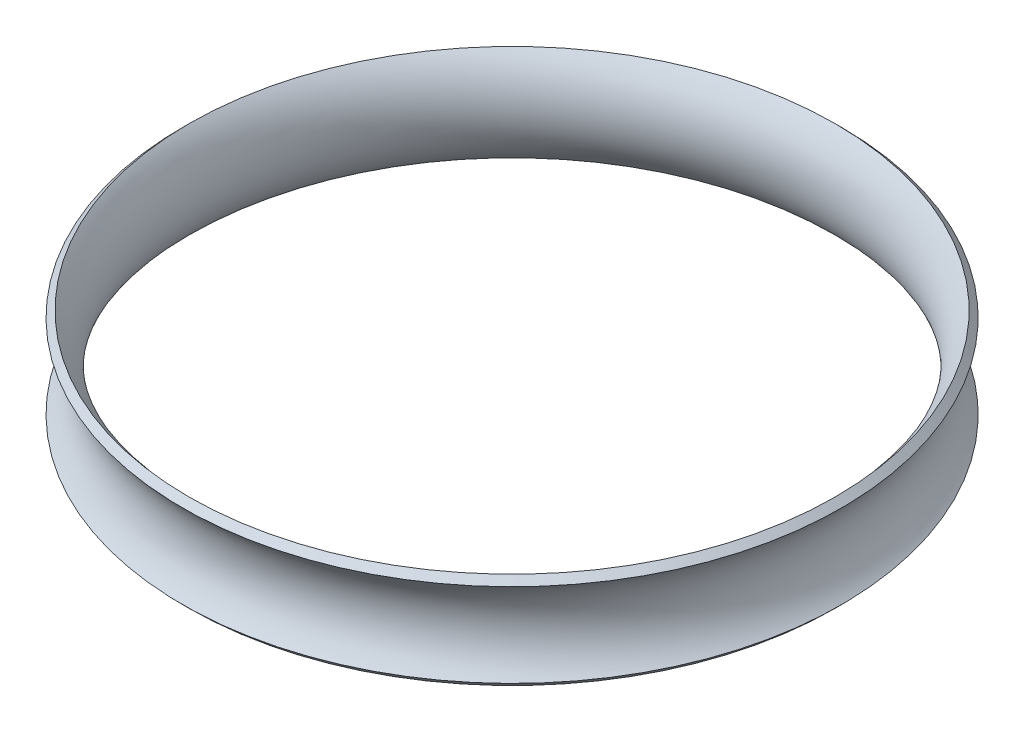
ISO-10303-21;
HEADER;
FILE_DESCRIPTION(('STEP AP214'),'2;1');
FILE_NAME('part.step','',(''),(''),'','','');
FILE_SCHEMA(('AUTOMOTIVE_DESIGN { 1 0 10303 214 1 1 1 1 }'));
ENDSEC;
DATA;
#1=APPLICATION_CONTEXT('core data for automotive mechanical design processes');
#2=APPLICATION_PROTOCOL_DEFINITION('international standard','automotive_design',2000,#1);
#3=PRODUCT_CONTEXT('',#1,'mechanical');
#4=PRODUCT('Part','Part','',(#3));
#5=PRODUCT_RELATED_PRODUCT_CATEGORY('part','',(#4));
#6=PRODUCT_DEFINITION_FORMATION('','',#4);
#7=PRODUCT_DEFINITION_CONTEXT('part definition',#1,'design');
#8=PRODUCT_DEFINITION('design','',#6,#7);
#9=PRODUCT_DEFINITION_SHAPE('','',#8);
#10=(LENGTH_UNIT() NAMED_UNIT(*) SI_UNIT(.MILLI.,.METRE.));
#11=(NAMED_UNIT(*) PLANE_ANGLE_UNIT() SI_UNIT($,.RADIAN.));
#12=(NAMED_UNIT(*) SI_UNIT($,.STERADIAN.) SOLID_ANGLE_UNIT());
#13=UNCERTAINTY_MEASURE_WITH_UNIT(LENGTH_MEASURE(1.E-05),#10,'distance_accuracy_value','');
#14=(GEOMETRIC_REPRESENTATION_CONTEXT(3) GLOBAL_UNCERTAINTY_ASSIGNED_CONTEXT((#13)) GLOBAL_UNIT_ASSIGNED_CONTEXT((#10,
#11,#12)) REPRESENTATION_CONTEXT('',''));
#15=CARTESIAN_POINT('',(0.,0.,0.));
#16=DIRECTION('',(0.,0.,1.));
#17=DIRECTION('',(1.,0.,0.));
#18=AXIS2_PLACEMENT_3D('',#15,#16,#17);
#19=CARTESIAN_POINT('',(0.,11.811,0.));
#20=DIRECTION('',(0.,-1.,0.));
#21=DIRECTION('',(0.,0.,-1.));
#22=AXIS2_PLACEMENT_3D('',#19,#20,#21);
#23=TOROIDAL_SURFACE('',#22,104.797360128,19.2432763851886);
#24=CARTESIAN_POINT('',(0.,-1.79605122421383,0.));
#25=DIRECTION('',(0.,-1.,0.));
#26=DIRECTION('',(0.,0.,-1.));
#27=AXIS2_PLACEMENT_3D('',#24,#25,#26);
#28=CIRCLE('',#27,91.1903089037862);
#29=CARTESIAN_POINT('',(0.,-1.79605122421383,-91.1903089037862));
#30=VERTEX_POINT('',#29);
#31=EDGE_CURVE('E10',#30,#30,#28,.T.);
#32=ORIENTED_EDGE('',*,*,#31,.T.);
#33=EDGE_LOOP('',(#32));
#34=FACE_BOUND('',#33,.T.);
#35=CARTESIAN_POINT('',(0.,25.4180512242138,0.));
#36=DIRECTION('',(0.,-1.,0.));
#37=DIRECTION('',(0.,0.,-1.));
#38=AXIS2_PLACEMENT_3D('',#35,#36,#37);
#39=CIRCLE('',#38,91.1903089037862);
#40=CARTESIAN_POINT('',(0.,25.4180512242138,-91.1903089037862));
#41=VERTEX_POINT('',#40);
#42=EDGE_CURVE('E49',#41,#41,#39,.T.);
#43=ORIENTED_EDGE('',*,*,#42,.F.);
#44=EDGE_LOOP('',(#43));
#45=FACE_BOUND('',#44,.T.);
#46=ADVANCED_FACE('F35',(#34,#45),#23,.T.);
#47=CARTESIAN_POINT('',(0.,0.,0.));
#48=DIRECTION('',(0.,1.,0.));
#49=DIRECTION('',(0.,0.,1.));
#50=AXIS2_PLACEMENT_3D('',#47,#48,#49);
#51=CONICAL_SURFACE('',#50,92.986360128,0.785398163397449);
#52=ORIENTED_EDGE('',*,*,#31,.F.);
#53=EDGE_LOOP('',(#52));
#54=FACE_BOUND('',#53,.T.);
#55=CARTESIAN_POINT('',(0.,0.,0.));
#56=DIRECTION('',(0.,-1.,0.));
#57=DIRECTION('',(0.,0.,-1.));
#58=AXIS2_PLACEMENT_3D('',#55,#56,#57);
#59=CIRCLE('',#58,92.986360128);
#60=CARTESIAN_POINT('',(0.,0.,-92.986360128));
#61=VERTEX_POINT('',#60);
#62=EDGE_CURVE('E41',#61,#61,#59,.T.);
#63=ORIENTED_EDGE('',*,*,#62,.T.);
#64=EDGE_LOOP('',(#63));
#65=FACE_BOUND('',#64,.T.);
#66=ADVANCED_FACE('F58',(#54,#65),#51,.T.);
#67=CARTESIAN_POINT('',(0.,11.811,0.));
#68=DIRECTION('',(0.,-1.,0.));
#69=DIRECTION('',(0.,0.,-1.));
#70=AXIS2_PLACEMENT_3D('',#67,#68,#69);
#71=TOROIDAL_SURFACE('',#70,104.797360128,16.7032763851886);
#72=ORIENTED_EDGE('',*,*,#62,.F.);
#73=EDGE_LOOP('',(#72));
#74=FACE_BOUND('',#73,.T.);
#75=CARTESIAN_POINT('',(0.,23.622,0.));
#76=DIRECTION('',(0.,-1.,0.));
#77=DIRECTION('',(0.,0.,-1.));
#78=AXIS2_PLACEMENT_3D('',#75,#76,#77);
#79=CIRCLE('',#78,92.986360128);
#80=CARTESIAN_POINT('',(0.,23.622,-92.986360128));
#81=VERTEX_POINT('',#80);
#82=EDGE_CURVE('E45',#81,#81,#79,.T.);
#83=ORIENTED_EDGE('',*,*,#82,.T.);
#84=EDGE_LOOP('',(#83));
#85=FACE_BOUND('',#84,.T.);
#86=ADVANCED_FACE('F62',(#74,#85),#71,.F.);
#87=CARTESIAN_POINT('',(0.,25.4180512242138,0.));
#88=DIRECTION('',(0.,-1.,0.));
#89=DIRECTION('',(0.,0.,-1.));
#90=AXIS2_PLACEMENT_3D('',#87,#88,#89);
#91=CONICAL_SURFACE('',#90,91.1903089037862,0.785398163397449);
#92=ORIENTED_EDGE('',*,*,#82,.F.);
#93=EDGE_LOOP('',(#92));
#94=FACE_BOUND('',#93,.T.);
#95=ORIENTED_EDGE('',*,*,#42,.T.);
#96=EDGE_LOOP('',(#95));
#97=FACE_BOUND('',#96,.T.);
#98=ADVANCED_FACE('F55',(#94,#97),#91,.T.);
#99=CLOSED_SHELL('',(#46,#66,#86,#98));
#100=MANIFOLD_SOLID_BREP('B2',#99);
#101=ADVANCED_BREP_SHAPE_REPRESENTATION('',(#18,#100),#14);
#102=SHAPE_DEFINITION_REPRESENTATION(#9,#101);
ENDSEC;
END-ISO-10303-21;
